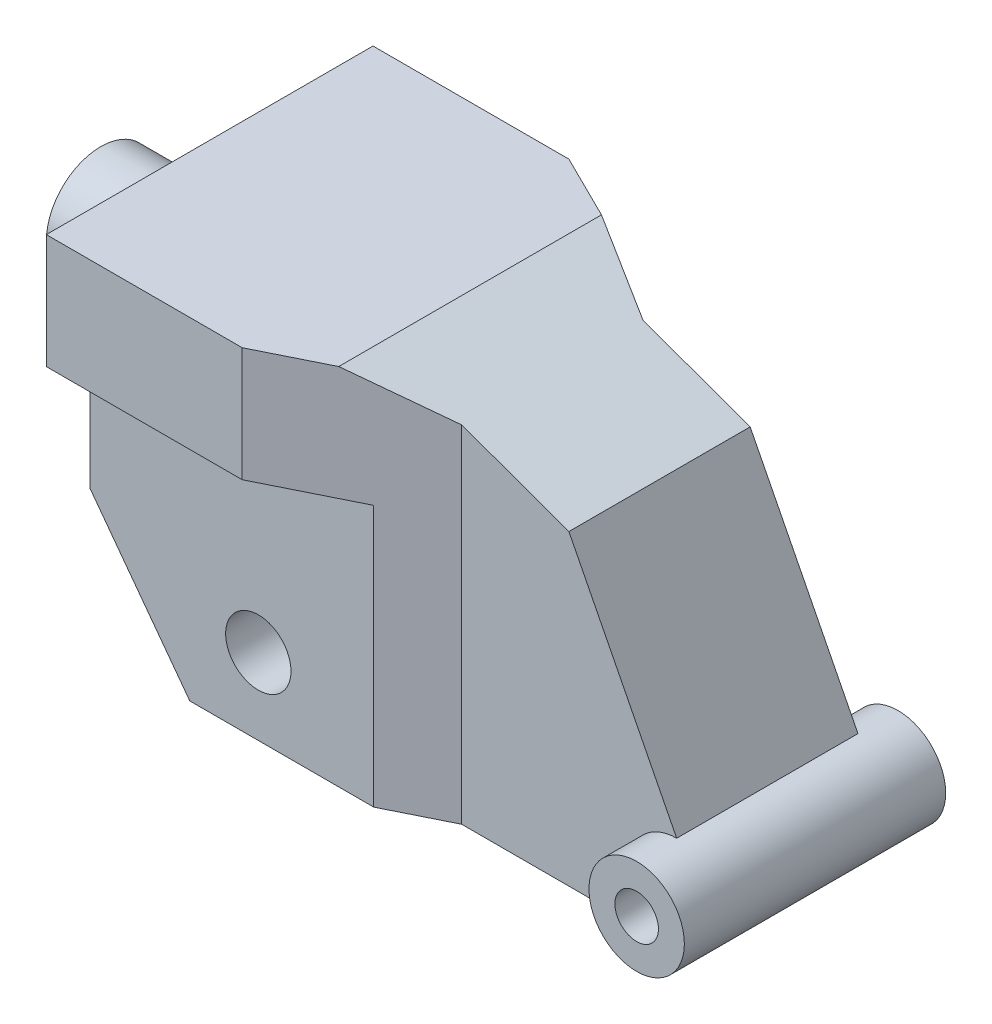
ISO-10303-21;
HEADER;
FILE_DESCRIPTION(('STEP AP214'),'2;1');
FILE_NAME('part.step','',(''),(''),'','','');
FILE_SCHEMA(('AUTOMOTIVE_DESIGN { 1 0 10303 214 1 1 1 1 }'));
ENDSEC;
DATA;
#1=APPLICATION_CONTEXT('core data for automotive mechanical design processes');
#2=APPLICATION_PROTOCOL_DEFINITION('international standard','automotive_design',2000,#1);
#3=PRODUCT_CONTEXT('',#1,'mechanical');
#4=PRODUCT('Part','Part','',(#3));
#5=PRODUCT_RELATED_PRODUCT_CATEGORY('part','',(#4));
#6=PRODUCT_DEFINITION_FORMATION('','',#4);
#7=PRODUCT_DEFINITION_CONTEXT('part definition',#1,'design');
#8=PRODUCT_DEFINITION('design','',#6,#7);
#9=PRODUCT_DEFINITION_SHAPE('','',#8);
#10=(LENGTH_UNIT() NAMED_UNIT(*) SI_UNIT(.MILLI.,.METRE.));
#11=(NAMED_UNIT(*) PLANE_ANGLE_UNIT() SI_UNIT($,.RADIAN.));
#12=(NAMED_UNIT(*) SI_UNIT($,.STERADIAN.) SOLID_ANGLE_UNIT());
#13=UNCERTAINTY_MEASURE_WITH_UNIT(LENGTH_MEASURE(1.E-05),#10,'distance_accuracy_value','');
#14=(GEOMETRIC_REPRESENTATION_CONTEXT(3) GLOBAL_UNCERTAINTY_ASSIGNED_CONTEXT((#13)) GLOBAL_UNIT_ASSIGNED_CONTEXT((#10,
#11,#12)) REPRESENTATION_CONTEXT('',''));
#15=CARTESIAN_POINT('',(0.,0.,0.));
#16=DIRECTION('',(0.,0.,1.));
#17=DIRECTION('',(1.,0.,0.));
#18=AXIS2_PLACEMENT_3D('',#15,#16,#17);
#19=CARTESIAN_POINT('',(-119.6,61.7014160677212,75.));
#20=DIRECTION('',(1.,0.,0.));
#21=DIRECTION('',(0.,1.,0.));
#22=AXIS2_PLACEMENT_3D('',#19,#20,#21);
#23=PLANE('',#22);
#24=CARTESIAN_POINT('',(-119.6,120.,0.));
#25=DIRECTION('',(1.,0.,0.));
#26=DIRECTION('',(0.,1.,0.));
#27=AXIS2_PLACEMENT_3D('',#24,#25,#26);
#28=CIRCLE('',#27,25.);
#29=CARTESIAN_POINT('',(-119.6,145.,0.));
#30=VERTEX_POINT('',#29);
#31=EDGE_CURVE('E11',#30,#30,#28,.F.);
#32=ORIENTED_EDGE('',*,*,#31,.F.);
#33=EDGE_LOOP('',(#32));
#34=FACE_BOUND('',#33,.T.);
#35=DIRECTION('',(0.,-1.,0.));
#36=VECTOR('',#35,1.);
#37=CARTESIAN_POINT('',(-119.6,61.7014160677212,55.));
#38=LINE('',#37,#36);
#39=CARTESIAN_POINT('',(-119.6,120.,55.));
#40=VERTEX_POINT('',#39);
#41=CARTESIAN_POINT('',(-119.6,61.7014160677212,55.));
#42=VERTEX_POINT('',#41);
#43=EDGE_CURVE('E238',#40,#42,#38,.T.);
#44=ORIENTED_EDGE('',*,*,#43,.F.);
#45=DIRECTION('',(0.,0.,-1.));
#46=VECTOR('',#45,1.);
#47=CARTESIAN_POINT('',(-119.6,120.,75.));
#48=LINE('',#47,#46);
#49=CARTESIAN_POINT('',(-119.6,120.,75.));
#50=VERTEX_POINT('',#49);
#51=EDGE_CURVE('E231',#50,#40,#48,.T.);
#52=ORIENTED_EDGE('',*,*,#51,.F.);
#53=DIRECTION('',(0.,-1.,0.));
#54=VECTOR('',#53,1.);
#55=CARTESIAN_POINT('',(-119.6,61.7014160677212,75.));
#56=LINE('',#55,#54);
#57=CARTESIAN_POINT('',(-119.6,172.501416067721,75.));
#58=VERTEX_POINT('',#57);
#59=EDGE_CURVE('E255',#58,#50,#56,.T.);
#60=ORIENTED_EDGE('',*,*,#59,.F.);
#61=DIRECTION('',(0.,0.,-1.));
#62=VECTOR('',#61,1.);
#63=CARTESIAN_POINT('',(-119.6,172.501416067721,75.));
#64=LINE('',#63,#62);
#65=CARTESIAN_POINT('',(-119.6,172.501416067721,-75.));
#66=VERTEX_POINT('',#65);
#67=EDGE_CURVE('E261',#58,#66,#64,.T.);
#68=ORIENTED_EDGE('',*,*,#67,.T.);
#69=DIRECTION('',(0.,-1.,0.));
#70=VECTOR('',#69,1.);
#71=CARTESIAN_POINT('',(-119.6,61.7014160677212,-75.));
#72=LINE('',#71,#70);
#73=CARTESIAN_POINT('',(-119.6,120.,-75.));
#74=VERTEX_POINT('',#73);
#75=EDGE_CURVE('E254',#66,#74,#72,.T.);
#76=ORIENTED_EDGE('',*,*,#75,.T.);
#77=DIRECTION('',(0.,0.,1.));
#78=VECTOR('',#77,1.);
#79=CARTESIAN_POINT('',(-119.6,120.,75.));
#80=LINE('',#79,#78);
#81=CARTESIAN_POINT('',(-119.6,120.,-55.));
#82=VERTEX_POINT('',#81);
#83=EDGE_CURVE('E244',#74,#82,#80,.T.);
#84=ORIENTED_EDGE('',*,*,#83,.T.);
#85=DIRECTION('',(0.,1.,0.));
#86=VECTOR('',#85,1.);
#87=CARTESIAN_POINT('',(-119.6,61.7014160677212,-55.));
#88=LINE('',#87,#86);
#89=CARTESIAN_POINT('',(-119.6,61.7014160677212,-55.));
#90=VERTEX_POINT('',#89);
#91=EDGE_CURVE('E252',#90,#82,#88,.T.);
#92=ORIENTED_EDGE('',*,*,#91,.F.);
#93=DIRECTION('',(0.,0.,-1.));
#94=VECTOR('',#93,1.);
#95=CARTESIAN_POINT('',(-119.6,61.7014160677212,75.));
#96=LINE('',#95,#94);
#97=EDGE_CURVE('E273',#42,#90,#96,.T.);
#98=ORIENTED_EDGE('',*,*,#97,.F.);
#99=EDGE_LOOP('',(#44,#52,#60,#68,#76,#84,#92,#98));
#100=FACE_BOUND('',#99,.T.);
#101=ADVANCED_FACE('F35',(#34,#100),#23,.F.);
#102=CARTESIAN_POINT('',(-73.7196408553948,0.,75.));
#103=DIRECTION('',(0.80246346817169,0.596701250417547,0.));
#104=DIRECTION('',(-0.596701250417547,0.80246346817169,0.));
#105=AXIS2_PLACEMENT_3D('',#102,#103,#104);
#106=PLANE('',#105);
#107=DIRECTION('',(0.596701250417547,-0.80246346817169,0.));
#108=VECTOR('',#107,1.);
#109=CARTESIAN_POINT('',(-73.7196408553948,0.,55.));
#110=LINE('',#109,#108);
#111=CARTESIAN_POINT('',(-73.7196408553948,0.,55.));
#112=VERTEX_POINT('',#111);
#113=EDGE_CURVE('E235',#42,#112,#110,.T.);
#114=ORIENTED_EDGE('',*,*,#113,.F.);
#115=ORIENTED_EDGE('',*,*,#97,.T.);
#116=DIRECTION('',(-0.596701250417547,0.80246346817169,0.));
#117=VECTOR('',#116,1.);
#118=CARTESIAN_POINT('',(-73.7196408553948,0.,-55.));
#119=LINE('',#118,#117);
#120=CARTESIAN_POINT('',(-73.7196408553948,0.,-55.));
#121=VERTEX_POINT('',#120);
#122=EDGE_CURVE('E249',#121,#90,#119,.T.);
#123=ORIENTED_EDGE('',*,*,#122,.F.);
#124=DIRECTION('',(0.,0.,-1.));
#125=VECTOR('',#124,1.);
#126=CARTESIAN_POINT('',(-73.7196408553948,0.,75.));
#127=LINE('',#126,#125);
#128=EDGE_CURVE('E152',#112,#121,#127,.T.);
#129=ORIENTED_EDGE('',*,*,#128,.F.);
#130=EDGE_LOOP('',(#114,#115,#123,#129));
#131=FACE_BOUND('',#130,.T.);
#132=ADVANCED_FACE('F302',(#131),#106,.F.);
#133=CARTESIAN_POINT('',(136.480359144605,0.,75.));
#134=DIRECTION('',(0.,1.,0.));
#135=DIRECTION('',(-1.,0.,0.));
#136=AXIS2_PLACEMENT_3D('',#133,#134,#135);
#137=PLANE('',#136);
#138=DIRECTION('',(0.,0.,-1.));
#139=VECTOR('',#138,1.);
#140=CARTESIAN_POINT('',(136.480359144605,0.,75.));
#141=LINE('',#140,#139);
#142=CARTESIAN_POINT('',(136.480359144605,0.,41.6203295097789));
#143=VERTEX_POINT('',#142);
#144=CARTESIAN_POINT('',(136.480359144605,0.,-41.6203295097789));
#145=VERTEX_POINT('',#144);
#146=EDGE_CURVE('E142',#143,#145,#141,.T.);
#147=ORIENTED_EDGE('',*,*,#146,.F.);
#148=DIRECTION('',(-1.,0.,0.));
#149=VECTOR('',#148,1.);
#150=CARTESIAN_POINT('',(136.480359144605,0.,41.6203295097789));
#151=LINE('',#150,#149);
#152=CARTESIAN_POINT('',(37.776604868224,0.,41.6203295097789));
#153=VERTEX_POINT('',#152);
#154=EDGE_CURVE('E146',#143,#153,#151,.T.);
#155=ORIENTED_EDGE('',*,*,#154,.T.);
#156=DIRECTION('',(-0.896191161126215,0.,0.443668122270742));
#157=VECTOR('',#156,1.);
#158=CARTESIAN_POINT('',(103.779234526647,0.,8.94508784740378));
#159=LINE('',#158,#157);
#160=CARTESIAN_POINT('',(10.7502267485893,0.,55.));
#161=VERTEX_POINT('',#160);
#162=EDGE_CURVE('E205',#153,#161,#159,.T.);
#163=ORIENTED_EDGE('',*,*,#162,.T.);
#164=DIRECTION('',(-1.,0.,0.));
#165=VECTOR('',#164,1.);
#166=CARTESIAN_POINT('',(-144.6,0.,55.));
#167=LINE('',#166,#165);
#168=EDGE_CURVE('E228',#161,#112,#167,.T.);
#169=ORIENTED_EDGE('',*,*,#168,.T.);
#170=ORIENTED_EDGE('',*,*,#128,.T.);
#171=DIRECTION('',(1.,0.,0.));
#172=VECTOR('',#171,1.);
#173=CARTESIAN_POINT('',(-144.6,0.,-55.));
#174=LINE('',#173,#172);
#175=CARTESIAN_POINT('',(10.7502267485893,0.,-55.));
#176=VERTEX_POINT('',#175);
#177=EDGE_CURVE('E240',#121,#176,#174,.T.);
#178=ORIENTED_EDGE('',*,*,#177,.T.);
#179=DIRECTION('',(0.896191161126215,0.,0.443668122270742));
#180=VECTOR('',#179,1.);
#181=CARTESIAN_POINT('',(163.420951974522,0.,20.5811225604832));
#182=LINE('',#181,#180);
#183=CARTESIAN_POINT('',(37.776604868224,0.,-41.6203295097789));
#184=VERTEX_POINT('',#183);
#185=EDGE_CURVE('E219',#176,#184,#182,.T.);
#186=ORIENTED_EDGE('',*,*,#185,.T.);
#187=DIRECTION('',(1.,0.,0.));
#188=VECTOR('',#187,1.);
#189=CARTESIAN_POINT('',(136.480359144605,0.,-41.6203295097789));
#190=LINE('',#189,#188);
#191=EDGE_CURVE('E148',#184,#145,#190,.T.);
#192=ORIENTED_EDGE('',*,*,#191,.T.);
#193=EDGE_LOOP('',(#147,#155,#163,#169,#170,#178,#186,#192));
#194=FACE_BOUND('',#193,.T.);
#195=ADVANCED_FACE('F144',(#194),#137,.F.);
#196=CARTESIAN_POINT('',(0.,0.,75.));
#197=DIRECTION('',(0.,0.,-1.));
#198=DIRECTION('',(-1.,0.,0.));
#199=AXIS2_PLACEMENT_3D('',#196,#197,#198);
#200=PLANE('',#199);
#201=DIRECTION('',(-1.,0.,0.));
#202=VECTOR('',#201,1.);
#203=CARTESIAN_POINT('',(0.,120.,75.));
#204=LINE('',#203,#202);
#205=CARTESIAN_POINT('',(-29.64894173525,120.,75.));
#206=VERTEX_POINT('',#205);
#207=EDGE_CURVE('E278',#206,#50,#204,.T.);
#208=ORIENTED_EDGE('',*,*,#207,.F.);
#209=DIRECTION('',(0.,1.,0.));
#210=VECTOR('',#209,1.);
#211=CARTESIAN_POINT('',(-29.6489417352499,0.,75.));
#212=LINE('',#211,#210);
#213=CARTESIAN_POINT('',(-29.64894173525,172.501416067721,75.));
#214=VERTEX_POINT('',#213);
#215=EDGE_CURVE('E49',#206,#214,#212,.T.);
#216=ORIENTED_EDGE('',*,*,#215,.T.);
#217=DIRECTION('',(-1.,0.,0.));
#218=VECTOR('',#217,1.);
#219=CARTESIAN_POINT('',(-119.6,172.501416067721,75.));
#220=LINE('',#219,#218);
#221=EDGE_CURVE('E258',#214,#58,#220,.T.);
#222=ORIENTED_EDGE('',*,*,#221,.T.);
#223=ORIENTED_EDGE('',*,*,#59,.T.);
#224=EDGE_LOOP('',(#208,#216,#222,#223));
#225=FACE_BOUND('',#224,.T.);
#226=ADVANCED_FACE('F335',(#225),#200,.F.);
#227=CARTESIAN_POINT('',(0.,0.,-75.));
#228=DIRECTION('',(0.,0.,-1.));
#229=DIRECTION('',(-1.,0.,0.));
#230=AXIS2_PLACEMENT_3D('',#227,#228,#229);
#231=PLANE('',#230);
#232=DIRECTION('',(0.,1.,0.));
#233=VECTOR('',#232,1.);
#234=CARTESIAN_POINT('',(-29.6489417352499,0.,-75.));
#235=LINE('',#234,#233);
#236=CARTESIAN_POINT('',(-29.64894173525,120.,-75.));
#237=VERTEX_POINT('',#236);
#238=CARTESIAN_POINT('',(-29.64894173525,172.501416067721,-75.));
#239=VERTEX_POINT('',#238);
#240=EDGE_CURVE('E217',#237,#239,#235,.T.);
#241=ORIENTED_EDGE('',*,*,#240,.F.);
#242=DIRECTION('',(1.,0.,0.));
#243=VECTOR('',#242,1.);
#244=CARTESIAN_POINT('',(0.,120.,-75.));
#245=LINE('',#244,#243);
#246=EDGE_CURVE('E275',#74,#237,#245,.T.);
#247=ORIENTED_EDGE('',*,*,#246,.F.);
#248=ORIENTED_EDGE('',*,*,#75,.F.);
#249=DIRECTION('',(-1.,0.,0.));
#250=VECTOR('',#249,1.);
#251=CARTESIAN_POINT('',(-119.6,172.501416067721,-75.));
#252=LINE('',#251,#250);
#253=EDGE_CURVE('E259',#239,#66,#252,.T.);
#254=ORIENTED_EDGE('',*,*,#253,.F.);
#255=EDGE_LOOP('',(#241,#247,#248,#254));
#256=FACE_BOUND('',#255,.T.);
#257=ADVANCED_FACE('F316',(#256),#231,.T.);
#258=CARTESIAN_POINT('',(86.9793502220056,141.023763122216,75.));
#259=DIRECTION('',(-0.891143566656423,-0.453721438337301,0.));
#260=DIRECTION('',(0.453721438337301,-0.891143566656423,0.));
#261=AXIS2_PLACEMENT_3D('',#258,#259,#260);
#262=PLANE('',#261);
#263=DIRECTION('',(0.,0.,-1.));
#264=VECTOR('',#263,1.);
#265=CARTESIAN_POINT('',(86.9793502220056,141.023763122216,75.));
#266=LINE('',#265,#264);
#267=CARTESIAN_POINT('',(86.9793502220056,141.023763122216,41.6203295097789));
#268=VERTEX_POINT('',#267);
#269=CARTESIAN_POINT('',(86.9793502220056,141.023763122216,-41.6203295097789));
#270=VERTEX_POINT('',#269);
#271=EDGE_CURVE('E269',#268,#270,#266,.T.);
#272=ORIENTED_EDGE('',*,*,#271,.F.);
#273=DIRECTION('',(0.453721438337301,-0.891143566656423,0.));
#274=VECTOR('',#273,1.);
#275=CARTESIAN_POINT('',(86.9793502220056,141.023763122216,41.6203295097789));
#276=LINE('',#275,#274);
#277=CARTESIAN_POINT('',(136.480359144605,43.8,41.6203295097789));
#278=VERTEX_POINT('',#277);
#279=EDGE_CURVE('E162',#268,#278,#276,.T.);
#280=ORIENTED_EDGE('',*,*,#279,.T.);
#281=DIRECTION('',(0.,0.,-1.));
#282=VECTOR('',#281,1.);
#283=CARTESIAN_POINT('',(136.480359144605,43.8,75.));
#284=LINE('',#283,#282);
#285=CARTESIAN_POINT('',(136.480359144605,43.8,-41.6203295097789));
#286=VERTEX_POINT('',#285);
#287=EDGE_CURVE('E153',#278,#286,#284,.T.);
#288=ORIENTED_EDGE('',*,*,#287,.T.);
#289=DIRECTION('',(-0.453721438337301,0.891143566656423,0.));
#290=VECTOR('',#289,1.);
#291=CARTESIAN_POINT('',(86.9793502220056,141.023763122216,-41.6203295097789));
#292=LINE('',#291,#290);
#293=EDGE_CURVE('E224',#286,#270,#292,.T.);
#294=ORIENTED_EDGE('',*,*,#293,.T.);
#295=EDGE_LOOP('',(#272,#280,#288,#294));
#296=FACE_BOUND('',#295,.T.);
#297=ADVANCED_FACE('F333',(#296),#262,.F.);
#298=CARTESIAN_POINT('',(0.,172.501416067721,75.));
#299=DIRECTION('',(-0.340298950762221,-0.940317299697358,0.));
#300=DIRECTION('',(0.940317299697358,-0.340298950762221,0.));
#301=AXIS2_PLACEMENT_3D('',#298,#299,#300);
#302=PLANE('',#301);
#303=DIRECTION('',(0.852476115414325,-0.308509401793115,-0.422026565103853));
#304=VECTOR('',#303,1.);
#305=CARTESIAN_POINT('',(-5.28066691827425,174.412478867684,62.9362493182385));
#306=LINE('',#305,#304);
#307=CARTESIAN_POINT('',(0.,172.501416067721,60.3220039679231));
#308=VERTEX_POINT('',#307);
#309=CARTESIAN_POINT('',(37.7766048682239,158.830138293556,41.6203295097789));
#310=VERTEX_POINT('',#309);
#311=EDGE_CURVE('E207',#308,#310,#306,.T.);
#312=ORIENTED_EDGE('',*,*,#311,.T.);
#313=DIRECTION('',(0.940317299697358,-0.340298950762221,0.));
#314=VECTOR('',#313,1.);
#315=CARTESIAN_POINT('',(0.,172.501416067721,41.6203295097789));
#316=LINE('',#315,#314);
#317=EDGE_CURVE('E166',#310,#268,#316,.T.);
#318=ORIENTED_EDGE('',*,*,#317,.T.);
#319=ORIENTED_EDGE('',*,*,#271,.T.);
#320=DIRECTION('',(-0.940317299697358,0.340298950762221,0.));
#321=VECTOR('',#320,1.);
#322=CARTESIAN_POINT('',(0.,172.501416067721,-41.6203295097789));
#323=LINE('',#322,#321);
#324=CARTESIAN_POINT('',(37.7766048682239,158.830138293556,-41.6203295097789));
#325=VERTEX_POINT('',#324);
#326=EDGE_CURVE('E282',#270,#325,#323,.T.);
#327=ORIENTED_EDGE('',*,*,#326,.T.);
#328=DIRECTION('',(-0.852476115414325,0.308509401793115,-0.422026565103853));
#329=VECTOR('',#328,1.);
#330=CARTESIAN_POINT('',(48.6844681049333,154.882604396536,-36.2202860702349));
#331=LINE('',#330,#329);
#332=CARTESIAN_POINT('',(0.,172.501416067721,-60.3220039679231));
#333=VERTEX_POINT('',#332);
#334=EDGE_CURVE('E221',#325,#333,#331,.T.);
#335=ORIENTED_EDGE('',*,*,#334,.T.);
#336=DIRECTION('',(0.,0.,-1.));
#337=VECTOR('',#336,1.);
#338=CARTESIAN_POINT('',(0.,172.501416067721,75.));
#339=LINE('',#338,#337);
#340=EDGE_CURVE('E267',#308,#333,#339,.T.);
#341=ORIENTED_EDGE('',*,*,#340,.F.);
#342=EDGE_LOOP('',(#312,#318,#319,#327,#335,#341));
#343=FACE_BOUND('',#342,.T.);
#344=ADVANCED_FACE('F326',(#343),#302,.F.);
#345=CARTESIAN_POINT('',(-119.6,172.501416067721,75.));
#346=DIRECTION('',(0.,-1.,0.));
#347=DIRECTION('',(1.,0.,0.));
#348=AXIS2_PLACEMENT_3D('',#345,#346,#347);
#349=PLANE('',#348);
#350=ORIENTED_EDGE('',*,*,#221,.F.);
#351=DIRECTION('',(-0.896191161126215,0.,0.443668122270742));
#352=VECTOR('',#351,1.);
#353=CARTESIAN_POINT('',(37.7766048682239,172.501416067721,41.6203295097789));
#354=LINE('',#353,#352);
#355=EDGE_CURVE('E199',#308,#214,#354,.T.);
#356=ORIENTED_EDGE('',*,*,#355,.F.);
#357=ORIENTED_EDGE('',*,*,#340,.T.);
#358=DIRECTION('',(0.896191161126215,0.,0.443668122270742));
#359=VECTOR('',#358,1.);
#360=CARTESIAN_POINT('',(37.7766048682239,172.501416067721,-41.6203295097789));
#361=LINE('',#360,#359);
#362=EDGE_CURVE('E161',#239,#333,#361,.T.);
#363=ORIENTED_EDGE('',*,*,#362,.F.);
#364=ORIENTED_EDGE('',*,*,#253,.T.);
#365=ORIENTED_EDGE('',*,*,#67,.F.);
#366=EDGE_LOOP('',(#350,#356,#357,#363,#364,#365));
#367=FACE_BOUND('',#366,.T.);
#368=ADVANCED_FACE('F322',(#367),#349,.F.);
#369=CARTESIAN_POINT('',(-144.6,120.,-55.));
#370=DIRECTION('',(0.,0.,-1.));
#371=DIRECTION('',(-1.,0.,0.));
#372=AXIS2_PLACEMENT_3D('',#369,#370,#371);
#373=PLANE('',#372);
#374=CARTESIAN_POINT('',(-42.2497732514107,35.,-55.));
#375=DIRECTION('',(0.,0.,-1.));
#376=DIRECTION('',(-1.,0.,0.));
#377=AXIS2_PLACEMENT_3D('',#374,#375,#376);
#378=CIRCLE('',#377,15.);
#379=CARTESIAN_POINT('',(-57.2497732514107,35.,-55.));
#380=VERTEX_POINT('',#379);
#381=EDGE_CURVE('E179',#380,#380,#378,.T.);
#382=ORIENTED_EDGE('',*,*,#381,.F.);
#383=EDGE_LOOP('',(#382));
#384=FACE_BOUND('',#383,.T.);
#385=DIRECTION('',(0.,1.,0.));
#386=VECTOR('',#385,1.);
#387=CARTESIAN_POINT('',(10.7502267485893,120.,-55.));
#388=LINE('',#387,#386);
#389=CARTESIAN_POINT('',(10.7502267485892,120.,-55.));
#390=VERTEX_POINT('',#389);
#391=EDGE_CURVE('E57',#176,#390,#388,.T.);
#392=ORIENTED_EDGE('',*,*,#391,.F.);
#393=ORIENTED_EDGE('',*,*,#177,.F.);
#394=ORIENTED_EDGE('',*,*,#122,.T.);
#395=ORIENTED_EDGE('',*,*,#91,.T.);
#396=DIRECTION('',(1.,0.,0.));
#397=VECTOR('',#396,1.);
#398=CARTESIAN_POINT('',(-144.6,120.,-55.));
#399=LINE('',#398,#397);
#400=EDGE_CURVE('E241',#82,#390,#399,.T.);
#401=ORIENTED_EDGE('',*,*,#400,.T.);
#402=EDGE_LOOP('',(#392,#393,#394,#395,#401));
#403=FACE_BOUND('',#402,.T.);
#404=ADVANCED_FACE('F306',(#384,#403),#373,.T.);
#405=CARTESIAN_POINT('',(0.,120.,0.));
#406=DIRECTION('',(0.,1.,0.));
#407=DIRECTION('',(0.,0.,1.));
#408=AXIS2_PLACEMENT_3D('',#405,#406,#407);
#409=PLANE('',#408);
#410=ORIENTED_EDGE('',*,*,#246,.T.);
#411=DIRECTION('',(0.896191161126215,0.,0.443668122270742));
#412=VECTOR('',#411,1.);
#413=CARTESIAN_POINT('',(23.98471944363,120.,-48.4481360920411));
#414=LINE('',#413,#412);
#415=EDGE_CURVE('E280',#237,#390,#414,.T.);
#416=ORIENTED_EDGE('',*,*,#415,.T.);
#417=ORIENTED_EDGE('',*,*,#400,.F.);
#418=ORIENTED_EDGE('',*,*,#83,.F.);
#419=EDGE_LOOP('',(#410,#416,#417,#418));
#420=FACE_BOUND('',#419,.T.);
#421=ADVANCED_FACE('F309',(#420),#409,.F.);
#422=CARTESIAN_POINT('',(-144.6,120.,55.));
#423=DIRECTION('',(0.,0.,1.));
#424=DIRECTION('',(1.,0.,0.));
#425=AXIS2_PLACEMENT_3D('',#422,#423,#424);
#426=PLANE('',#425);
#427=CARTESIAN_POINT('',(-42.2497732514107,35.,55.));
#428=DIRECTION('',(0.,0.,1.));
#429=DIRECTION('',(1.,0.,0.));
#430=AXIS2_PLACEMENT_3D('',#427,#428,#429);
#431=CIRCLE('',#430,15.);
#432=CARTESIAN_POINT('',(-27.2497732514107,35.,55.));
#433=VERTEX_POINT('',#432);
#434=EDGE_CURVE('E177',#433,#433,#431,.T.);
#435=ORIENTED_EDGE('',*,*,#434,.F.);
#436=EDGE_LOOP('',(#435));
#437=FACE_BOUND('',#436,.T.);
#438=DIRECTION('',(0.,-1.,0.));
#439=VECTOR('',#438,1.);
#440=CARTESIAN_POINT('',(10.7502267485893,120.,55.));
#441=LINE('',#440,#439);
#442=CARTESIAN_POINT('',(10.7502267485893,120.,55.));
#443=VERTEX_POINT('',#442);
#444=EDGE_CURVE('E202',#443,#161,#441,.T.);
#445=ORIENTED_EDGE('',*,*,#444,.F.);
#446=DIRECTION('',(-1.,0.,0.));
#447=VECTOR('',#446,1.);
#448=CARTESIAN_POINT('',(-144.6,120.,55.));
#449=LINE('',#448,#447);
#450=EDGE_CURVE('E229',#443,#40,#449,.T.);
#451=ORIENTED_EDGE('',*,*,#450,.T.);
#452=ORIENTED_EDGE('',*,*,#43,.T.);
#453=ORIENTED_EDGE('',*,*,#113,.T.);
#454=ORIENTED_EDGE('',*,*,#168,.F.);
#455=EDGE_LOOP('',(#445,#451,#452,#453,#454));
#456=FACE_BOUND('',#455,.T.);
#457=ADVANCED_FACE('F291',(#437,#456),#426,.T.);
#458=CARTESIAN_POINT('',(0.,120.,0.));
#459=DIRECTION('',(0.,-1.,0.));
#460=DIRECTION('',(0.,0.,-1.));
#461=AXIS2_PLACEMENT_3D('',#458,#459,#460);
#462=PLANE('',#461);
#463=DIRECTION('',(0.896191161126215,0.,-0.443668122270742));
#464=VECTOR('',#463,1.);
#465=CARTESIAN_POINT('',(23.98471944363,120.,48.4481360920411));
#466=LINE('',#465,#464);
#467=EDGE_CURVE('E169',#206,#443,#466,.T.);
#468=ORIENTED_EDGE('',*,*,#467,.F.);
#469=ORIENTED_EDGE('',*,*,#207,.T.);
#470=ORIENTED_EDGE('',*,*,#51,.T.);
#471=ORIENTED_EDGE('',*,*,#450,.F.);
#472=EDGE_LOOP('',(#468,#469,#470,#471));
#473=FACE_BOUND('',#472,.T.);
#474=ADVANCED_FACE('F292',(#473),#462,.T.);
#475=CARTESIAN_POINT('',(245.362716919272,-227.498583932279,-41.6203295097789));
#476=DIRECTION('',(0.,0.,1.));
#477=DIRECTION('',(1.,0.,0.));
#478=AXIS2_PLACEMENT_3D('',#475,#476,#477);
#479=PLANE('',#478);
#480=CARTESIAN_POINT('',(136.480359144605,21.9,-41.6203295097789));
#481=DIRECTION('',(0.,0.,1.));
#482=DIRECTION('',(1.,0.,0.));
#483=AXIS2_PLACEMENT_3D('',#480,#481,#482);
#484=CIRCLE('',#483,21.9);
#485=EDGE_CURVE('E195',#145,#286,#484,.F.);
#486=ORIENTED_EDGE('',*,*,#485,.F.);
#487=ORIENTED_EDGE('',*,*,#191,.F.);
#488=DIRECTION('',(0.,1.,0.));
#489=VECTOR('',#488,1.);
#490=CARTESIAN_POINT('',(37.7766048682241,-227.498583932279,-41.6203295097789));
#491=LINE('',#490,#489);
#492=EDGE_CURVE('E213',#184,#325,#491,.T.);
#493=ORIENTED_EDGE('',*,*,#492,.T.);
#494=ORIENTED_EDGE('',*,*,#326,.F.);
#495=ORIENTED_EDGE('',*,*,#293,.F.);
#496=EDGE_LOOP('',(#486,#487,#493,#494,#495));
#497=FACE_BOUND('',#496,.T.);
#498=ADVANCED_FACE('F329',(#497),#479,.F.);
#499=CARTESIAN_POINT('',(37.7766048682241,-227.498583932279,-41.6203295097789));
#500=DIRECTION('',(-0.443668122270742,0.,0.896191161126215));
#501=DIRECTION('',(0.896191161126215,0.,0.443668122270742));
#502=AXIS2_PLACEMENT_3D('',#499,#500,#501);
#503=PLANE('',#502);
#504=ORIENTED_EDGE('',*,*,#492,.F.);
#505=ORIENTED_EDGE('',*,*,#185,.F.);
#506=ORIENTED_EDGE('',*,*,#391,.T.);
#507=ORIENTED_EDGE('',*,*,#415,.F.);
#508=ORIENTED_EDGE('',*,*,#240,.T.);
#509=ORIENTED_EDGE('',*,*,#362,.T.);
#510=ORIENTED_EDGE('',*,*,#334,.F.);
#511=EDGE_LOOP('',(#504,#505,#506,#507,#508,#509,#510));
#512=FACE_BOUND('',#511,.T.);
#513=ADVANCED_FACE('F319',(#512),#503,.F.);
#514=CARTESIAN_POINT('',(245.362716919272,-227.498583932279,41.6203295097789));
#515=DIRECTION('',(0.,0.,-1.));
#516=DIRECTION('',(-1.,0.,0.));
#517=AXIS2_PLACEMENT_3D('',#514,#515,#516);
#518=PLANE('',#517);
#519=CARTESIAN_POINT('',(136.480359144605,21.9,41.6203295097789));
#520=DIRECTION('',(0.,0.,-1.));
#521=DIRECTION('',(-1.,0.,0.));
#522=AXIS2_PLACEMENT_3D('',#519,#520,#521);
#523=CIRCLE('',#522,21.9);
#524=EDGE_CURVE('E42',#278,#143,#523,.F.);
#525=ORIENTED_EDGE('',*,*,#524,.F.);
#526=ORIENTED_EDGE('',*,*,#279,.F.);
#527=ORIENTED_EDGE('',*,*,#317,.F.);
#528=DIRECTION('',(0.,1.,0.));
#529=VECTOR('',#528,1.);
#530=CARTESIAN_POINT('',(37.7766048682241,-227.498583932279,41.6203295097789));
#531=LINE('',#530,#529);
#532=EDGE_CURVE('E160',#153,#310,#531,.T.);
#533=ORIENTED_EDGE('',*,*,#532,.F.);
#534=ORIENTED_EDGE('',*,*,#154,.F.);
#535=EDGE_LOOP('',(#525,#526,#527,#533,#534));
#536=FACE_BOUND('',#535,.T.);
#537=ADVANCED_FACE('F157',(#536),#518,.F.);
#538=CARTESIAN_POINT('',(37.7766048682241,-227.498583932279,41.6203295097789));
#539=DIRECTION('',(-0.443668122270742,0.,-0.896191161126215));
#540=DIRECTION('',(-0.896191161126215,0.,0.443668122270742));
#541=AXIS2_PLACEMENT_3D('',#538,#539,#540);
#542=PLANE('',#541);
#543=ORIENTED_EDGE('',*,*,#355,.T.);
#544=ORIENTED_EDGE('',*,*,#215,.F.);
#545=ORIENTED_EDGE('',*,*,#467,.T.);
#546=ORIENTED_EDGE('',*,*,#444,.T.);
#547=ORIENTED_EDGE('',*,*,#162,.F.);
#548=ORIENTED_EDGE('',*,*,#532,.T.);
#549=ORIENTED_EDGE('',*,*,#311,.F.);
#550=EDGE_LOOP('',(#543,#544,#545,#546,#547,#548,#549));
#551=FACE_BOUND('',#550,.T.);
#552=ADVANCED_FACE('F285',(#551),#542,.F.);
#553=CARTESIAN_POINT('',(136.480359144605,21.9,60.));
#554=DIRECTION('',(0.,0.,-1.));
#555=DIRECTION('',(-1.,0.,0.));
#556=AXIS2_PLACEMENT_3D('',#553,#554,#555);
#557=CYLINDRICAL_SURFACE('',#556,21.9);
#558=CARTESIAN_POINT('',(136.480359144605,21.9,60.));
#559=DIRECTION('',(0.,0.,1.));
#560=DIRECTION('',(1.,0.,0.));
#561=AXIS2_PLACEMENT_3D('',#558,#559,#560);
#562=CIRCLE('',#561,21.9);
#563=CARTESIAN_POINT('',(158.380359144605,21.9,60.));
#564=VERTEX_POINT('',#563);
#565=EDGE_CURVE('E192',#564,#564,#562,.T.);
#566=ORIENTED_EDGE('',*,*,#565,.F.);
#567=EDGE_LOOP('',(#566));
#568=FACE_BOUND('',#567,.T.);
#569=CARTESIAN_POINT('',(136.480359144605,21.9,-60.));
#570=DIRECTION('',(0.,0.,1.));
#571=DIRECTION('',(1.,0.,0.));
#572=AXIS2_PLACEMENT_3D('',#569,#570,#571);
#573=CIRCLE('',#572,21.9);
#574=CARTESIAN_POINT('',(158.380359144605,21.9,-60.));
#575=VERTEX_POINT('',#574);
#576=EDGE_CURVE('E175',#575,#575,#573,.T.);
#577=ORIENTED_EDGE('',*,*,#576,.T.);
#578=EDGE_LOOP('',(#577));
#579=FACE_BOUND('',#578,.T.);
#580=ORIENTED_EDGE('',*,*,#146,.T.);
#581=ORIENTED_EDGE('',*,*,#485,.T.);
#582=ORIENTED_EDGE('',*,*,#287,.F.);
#583=ORIENTED_EDGE('',*,*,#524,.T.);
#584=EDGE_LOOP('',(#580,#581,#582,#583));
#585=FACE_BOUND('',#584,.T.);
#586=ADVANCED_FACE('F165',(#568,#579,#585),#557,.T.);
#587=CARTESIAN_POINT('',(136.480359144605,21.9,60.));
#588=DIRECTION('',(0.,0.,1.));
#589=DIRECTION('',(1.,0.,0.));
#590=AXIS2_PLACEMENT_3D('',#587,#588,#589);
#591=PLANE('',#590);
#592=CARTESIAN_POINT('',(136.480359144605,21.9,60.));
#593=DIRECTION('',(0.,0.,1.));
#594=DIRECTION('',(1.,0.,0.));
#595=AXIS2_PLACEMENT_3D('',#592,#593,#594);
#596=CIRCLE('',#595,10.);
#597=CARTESIAN_POINT('',(146.480359144605,21.9,60.));
#598=VERTEX_POINT('',#597);
#599=EDGE_CURVE('E176',#598,#598,#596,.T.);
#600=ORIENTED_EDGE('',*,*,#599,.F.);
#601=EDGE_LOOP('',(#600));
#602=FACE_BOUND('',#601,.T.);
#603=ORIENTED_EDGE('',*,*,#565,.T.);
#604=EDGE_LOOP('',(#603));
#605=FACE_BOUND('',#604,.T.);
#606=ADVANCED_FACE('F371',(#602,#605),#591,.T.);
#607=CARTESIAN_POINT('',(136.480359144605,21.9,-60.));
#608=DIRECTION('',(0.,0.,1.));
#609=DIRECTION('',(1.,0.,0.));
#610=AXIS2_PLACEMENT_3D('',#607,#608,#609);
#611=PLANE('',#610);
#612=CARTESIAN_POINT('',(136.480359144605,21.9,-60.));
#613=DIRECTION('',(0.,0.,1.));
#614=DIRECTION('',(1.,0.,0.));
#615=AXIS2_PLACEMENT_3D('',#612,#613,#614);
#616=CIRCLE('',#615,10.);
#617=CARTESIAN_POINT('',(146.480359144605,21.9,-60.));
#618=VERTEX_POINT('',#617);
#619=EDGE_CURVE('E173',#618,#618,#616,.T.);
#620=ORIENTED_EDGE('',*,*,#619,.T.);
#621=EDGE_LOOP('',(#620));
#622=FACE_BOUND('',#621,.T.);
#623=ORIENTED_EDGE('',*,*,#576,.F.);
#624=EDGE_LOOP('',(#623));
#625=FACE_BOUND('',#624,.T.);
#626=ADVANCED_FACE('F369',(#622,#625),#611,.F.);
#627=CARTESIAN_POINT('',(136.480359144605,21.9,-140.));
#628=DIRECTION('',(0.,0.,1.));
#629=DIRECTION('',(1.,0.,0.));
#630=AXIS2_PLACEMENT_3D('',#627,#628,#629);
#631=CYLINDRICAL_SURFACE('',#630,10.);
#632=ORIENTED_EDGE('',*,*,#599,.T.);
#633=EDGE_LOOP('',(#632));
#634=FACE_BOUND('',#633,.T.);
#635=ORIENTED_EDGE('',*,*,#619,.F.);
#636=EDGE_LOOP('',(#635));
#637=FACE_BOUND('',#636,.T.);
#638=ADVANCED_FACE('F363',(#634,#637),#631,.F.);
#639=CARTESIAN_POINT('',(-42.2497732514107,35.,-75.));
#640=DIRECTION('',(0.,0.,1.));
#641=DIRECTION('',(1.,0.,0.));
#642=AXIS2_PLACEMENT_3D('',#639,#640,#641);
#643=CYLINDRICAL_SURFACE('',#642,15.);
#644=ORIENTED_EDGE('',*,*,#381,.T.);
#645=EDGE_LOOP('',(#644));
#646=FACE_BOUND('',#645,.T.);
#647=ORIENTED_EDGE('',*,*,#434,.T.);
#648=EDGE_LOOP('',(#647));
#649=FACE_BOUND('',#648,.T.);
#650=ADVANCED_FACE('F355',(#646,#649),#643,.F.);
#651=CARTESIAN_POINT('',(-169.6,120.,0.));
#652=DIRECTION('',(1.,0.,0.));
#653=DIRECTION('',(0.,1.,0.));
#654=AXIS2_PLACEMENT_3D('',#651,#652,#653);
#655=CYLINDRICAL_SURFACE('',#654,25.);
#656=CARTESIAN_POINT('',(-169.6,120.,0.));
#657=DIRECTION('',(-1.,0.,0.));
#658=DIRECTION('',(0.,-1.,0.));
#659=AXIS2_PLACEMENT_3D('',#656,#657,#658);
#660=CIRCLE('',#659,25.);
#661=CARTESIAN_POINT('',(-169.6,95.,0.));
#662=VERTEX_POINT('',#661);
#663=EDGE_CURVE('E180',#662,#662,#660,.T.);
#664=ORIENTED_EDGE('',*,*,#663,.F.);
#665=EDGE_LOOP('',(#664));
#666=FACE_BOUND('',#665,.T.);
#667=ORIENTED_EDGE('',*,*,#31,.T.);
#668=EDGE_LOOP('',(#667));
#669=FACE_BOUND('',#668,.T.);
#670=ADVANCED_FACE('F352',(#666,#669),#655,.T.);
#671=CARTESIAN_POINT('',(-169.6,120.,0.));
#672=DIRECTION('',(-1.,0.,0.));
#673=DIRECTION('',(0.,-1.,0.));
#674=AXIS2_PLACEMENT_3D('',#671,#672,#673);
#675=PLANE('',#674);
#676=ORIENTED_EDGE('',*,*,#663,.T.);
#677=EDGE_LOOP('',(#676));
#678=FACE_BOUND('',#677,.T.);
#679=ADVANCED_FACE('F354',(#678),#675,.T.);
#680=CLOSED_SHELL('',(#101,#132,#195,#226,#257,#297,#344,#368,#404,#421,#457,#474,#498,#513,
#537,#552,#586,#606,#626,#638,#650,#670,#679));
#681=MANIFOLD_SOLID_BREP('B2',#680);
#682=ADVANCED_BREP_SHAPE_REPRESENTATION('',(#18,#681),#14);
#683=SHAPE_DEFINITION_REPRESENTATION(#9,#682);
ENDSEC;
END-ISO-10303-21;
